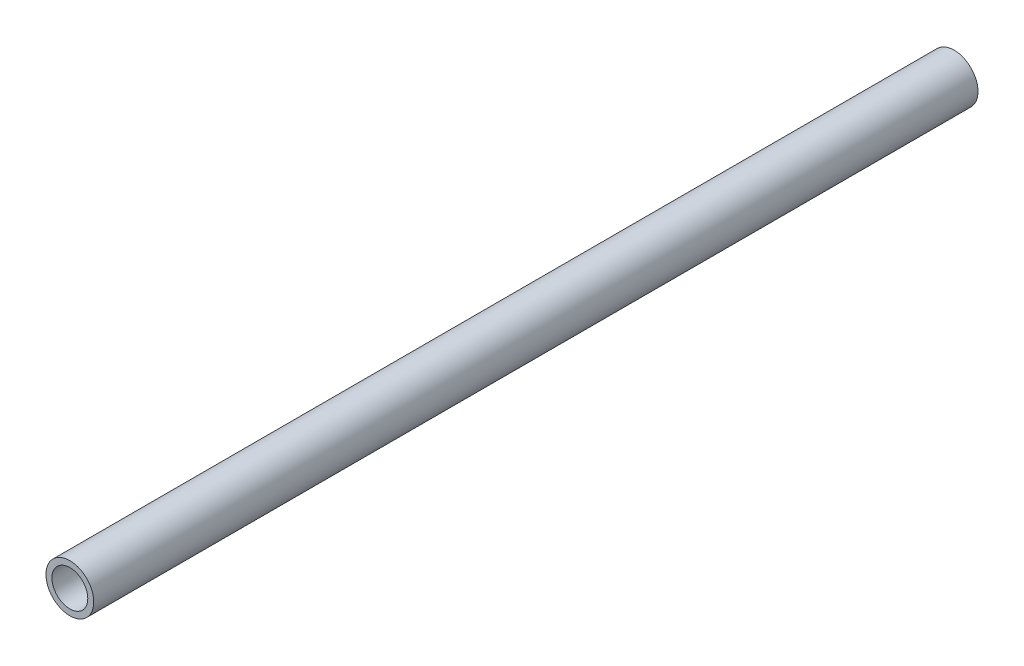
ISO-10303-21;
HEADER;
FILE_DESCRIPTION(('STEP AP214'),'2;1');
FILE_NAME('part.step','',(''),(''),'','','');
FILE_SCHEMA(('AUTOMOTIVE_DESIGN { 1 0 10303 214 1 1 1 1 }'));
ENDSEC;
DATA;
#1=APPLICATION_CONTEXT('core data for automotive mechanical design processes');
#2=APPLICATION_PROTOCOL_DEFINITION('international standard','automotive_design',2000,#1);
#3=PRODUCT_CONTEXT('',#1,'mechanical');
#4=PRODUCT('Part','Part','',(#3));
#5=PRODUCT_RELATED_PRODUCT_CATEGORY('part','',(#4));
#6=PRODUCT_DEFINITION_FORMATION('','',#4);
#7=PRODUCT_DEFINITION_CONTEXT('part definition',#1,'design');
#8=PRODUCT_DEFINITION('design','',#6,#7);
#9=PRODUCT_DEFINITION_SHAPE('','',#8);
#10=(LENGTH_UNIT() NAMED_UNIT(*) SI_UNIT(.MILLI.,.METRE.));
#11=(NAMED_UNIT(*) PLANE_ANGLE_UNIT() SI_UNIT($,.RADIAN.));
#12=(NAMED_UNIT(*) SI_UNIT($,.STERADIAN.) SOLID_ANGLE_UNIT());
#13=UNCERTAINTY_MEASURE_WITH_UNIT(LENGTH_MEASURE(1.E-05),#10,'distance_accuracy_value','');
#14=(GEOMETRIC_REPRESENTATION_CONTEXT(3) GLOBAL_UNCERTAINTY_ASSIGNED_CONTEXT((#13)) GLOBAL_UNIT_ASSIGNED_CONTEXT((#10,
#11,#12)) REPRESENTATION_CONTEXT('',''));
#15=CARTESIAN_POINT('',(0.,0.,0.));
#16=DIRECTION('',(0.,0.,1.));
#17=DIRECTION('',(1.,0.,0.));
#18=AXIS2_PLACEMENT_3D('',#15,#16,#17);
#19=CARTESIAN_POINT('',(0.,0.,469.9));
#20=DIRECTION('',(0.,0.,1.));
#21=DIRECTION('',(1.,0.,0.));
#22=AXIS2_PLACEMENT_3D('',#19,#20,#21);
#23=PLANE('',#22);
#24=CARTESIAN_POINT('',(0.,0.,469.9));
#25=DIRECTION('',(0.,0.,1.));
#26=DIRECTION('',(1.,0.,0.));
#27=AXIS2_PLACEMENT_3D('',#24,#25,#26);
#28=CIRCLE('',#27,12.7);
#29=CARTESIAN_POINT('',(12.7,0.,469.9));
#30=VERTEX_POINT('',#29);
#31=EDGE_CURVE('E10',#30,#30,#28,.T.);
#32=ORIENTED_EDGE('',*,*,#31,.T.);
#33=EDGE_LOOP('',(#32));
#34=FACE_BOUND('',#33,.T.);
#35=CARTESIAN_POINT('',(0.,0.,469.9));
#36=DIRECTION('',(0.,0.,1.));
#37=DIRECTION('',(1.,0.,0.));
#38=AXIS2_PLACEMENT_3D('',#35,#36,#37);
#39=CIRCLE('',#38,9.525);
#40=CARTESIAN_POINT('',(9.525,0.,469.9));
#41=VERTEX_POINT('',#40);
#42=EDGE_CURVE('E44',#41,#41,#39,.T.);
#43=ORIENTED_EDGE('',*,*,#42,.F.);
#44=EDGE_LOOP('',(#43));
#45=FACE_BOUND('',#44,.T.);
#46=ADVANCED_FACE('F33',(#34,#45),#23,.T.);
#47=CARTESIAN_POINT('',(0.,0.,0.));
#48=DIRECTION('',(0.,0.,1.));
#49=DIRECTION('',(1.,0.,0.));
#50=AXIS2_PLACEMENT_3D('',#47,#48,#49);
#51=PLANE('',#50);
#52=CARTESIAN_POINT('',(0.,0.,0.));
#53=DIRECTION('',(0.,0.,1.));
#54=DIRECTION('',(1.,0.,0.));
#55=AXIS2_PLACEMENT_3D('',#52,#53,#54);
#56=CIRCLE('',#55,12.7);
#57=CARTESIAN_POINT('',(12.7,0.,0.));
#58=VERTEX_POINT('',#57);
#59=EDGE_CURVE('E37',#58,#58,#56,.T.);
#60=ORIENTED_EDGE('',*,*,#59,.F.);
#61=EDGE_LOOP('',(#60));
#62=FACE_BOUND('',#61,.T.);
#63=CARTESIAN_POINT('',(0.,0.,0.));
#64=DIRECTION('',(0.,0.,1.));
#65=DIRECTION('',(1.,0.,0.));
#66=AXIS2_PLACEMENT_3D('',#63,#64,#65);
#67=CIRCLE('',#66,9.525);
#68=CARTESIAN_POINT('',(9.525,0.,0.));
#69=VERTEX_POINT('',#68);
#70=EDGE_CURVE('E46',#69,#69,#67,.T.);
#71=ORIENTED_EDGE('',*,*,#70,.T.);
#72=EDGE_LOOP('',(#71));
#73=FACE_BOUND('',#72,.T.);
#74=ADVANCED_FACE('F56',(#62,#73),#51,.F.);
#75=CARTESIAN_POINT('',(0.,0.,469.9));
#76=DIRECTION('',(0.,0.,-1.));
#77=DIRECTION('',(-1.,0.,0.));
#78=AXIS2_PLACEMENT_3D('',#75,#76,#77);
#79=CYLINDRICAL_SURFACE('',#78,12.7);
#80=ORIENTED_EDGE('',*,*,#31,.F.);
#81=EDGE_LOOP('',(#80));
#82=FACE_BOUND('',#81,.T.);
#83=ORIENTED_EDGE('',*,*,#59,.T.);
#84=EDGE_LOOP('',(#83));
#85=FACE_BOUND('',#84,.T.);
#86=ADVANCED_FACE('F35',(#82,#85),#79,.T.);
#87=CARTESIAN_POINT('',(0.,0.,469.9));
#88=DIRECTION('',(0.,0.,-1.));
#89=DIRECTION('',(-1.,0.,0.));
#90=AXIS2_PLACEMENT_3D('',#87,#88,#89);
#91=CYLINDRICAL_SURFACE('',#90,9.525);
#92=ORIENTED_EDGE('',*,*,#42,.T.);
#93=EDGE_LOOP('',(#92));
#94=FACE_BOUND('',#93,.T.);
#95=ORIENTED_EDGE('',*,*,#70,.F.);
#96=EDGE_LOOP('',(#95));
#97=FACE_BOUND('',#96,.T.);
#98=ADVANCED_FACE('F52',(#94,#97),#91,.F.);
#99=CLOSED_SHELL('',(#46,#74,#86,#98));
#100=MANIFOLD_SOLID_BREP('B2',#99);
#101=ADVANCED_BREP_SHAPE_REPRESENTATION('',(#18,#100),#14);
#102=SHAPE_DEFINITION_REPRESENTATION(#9,#101);
ENDSEC;
END-ISO-10303-21;
